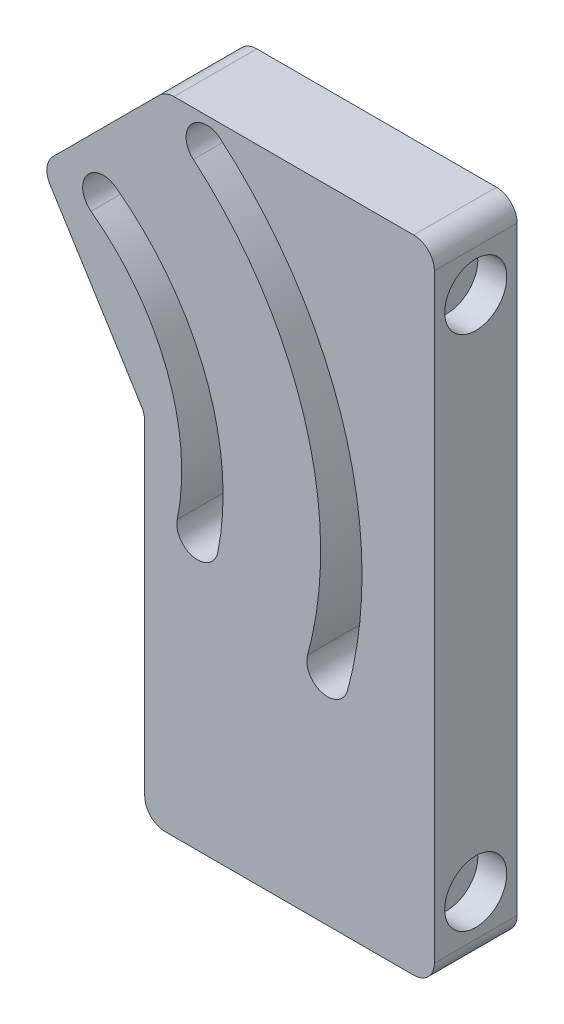
ISO-10303-21;
HEADER;
FILE_DESCRIPTION(('STEP AP214'),'2;1');
FILE_NAME('part.step','',(''),(''),'','','');
FILE_SCHEMA(('AUTOMOTIVE_DESIGN { 1 0 10303 214 1 1 1 1 }'));
ENDSEC;
DATA;
#1=APPLICATION_CONTEXT('core data for automotive mechanical design processes');
#2=APPLICATION_PROTOCOL_DEFINITION('international standard','automotive_design',2000,#1);
#3=PRODUCT_CONTEXT('',#1,'mechanical');
#4=PRODUCT('Part','Part','',(#3));
#5=PRODUCT_RELATED_PRODUCT_CATEGORY('part','',(#4));
#6=PRODUCT_DEFINITION_FORMATION('','',#4);
#7=PRODUCT_DEFINITION_CONTEXT('part definition',#1,'design');
#8=PRODUCT_DEFINITION('design','',#6,#7);
#9=PRODUCT_DEFINITION_SHAPE('','',#8);
#10=(LENGTH_UNIT() NAMED_UNIT(*) SI_UNIT(.MILLI.,.METRE.));
#11=(NAMED_UNIT(*) PLANE_ANGLE_UNIT() SI_UNIT($,.RADIAN.));
#12=(NAMED_UNIT(*) SI_UNIT($,.STERADIAN.) SOLID_ANGLE_UNIT());
#13=UNCERTAINTY_MEASURE_WITH_UNIT(LENGTH_MEASURE(1.E-05),#10,'distance_accuracy_value','');
#14=(GEOMETRIC_REPRESENTATION_CONTEXT(3) GLOBAL_UNCERTAINTY_ASSIGNED_CONTEXT((#13)) GLOBAL_UNIT_ASSIGNED_CONTEXT((#10,
#11,#12)) REPRESENTATION_CONTEXT('',''));
#15=CARTESIAN_POINT('',(0.,0.,0.));
#16=DIRECTION('',(0.,0.,1.));
#17=DIRECTION('',(1.,0.,0.));
#18=AXIS2_PLACEMENT_3D('',#15,#16,#17);
#19=CARTESIAN_POINT('',(0.,-196.747553987337,25.4));
#20=DIRECTION('',(0.,1.,0.));
#21=DIRECTION('',(0.,0.,1.));
#22=AXIS2_PLACEMENT_3D('',#19,#20,#21);
#23=PLANE('',#22);
#24=DIRECTION('',(1.,0.,0.));
#25=VECTOR('',#24,1.);
#26=CARTESIAN_POINT('',(0.,-196.747553987337,0.));
#27=LINE('',#26,#25);
#28=CARTESIAN_POINT('',(-82.55,-196.747553987337,0.));
#29=VERTEX_POINT('',#28);
#30=CARTESIAN_POINT('',(-6.34999999999997,-196.747553987337,0.));
#31=VERTEX_POINT('',#30);
#32=EDGE_CURVE('E254',#29,#31,#27,.T.);
#33=ORIENTED_EDGE('',*,*,#32,.T.);
#34=DIRECTION('',(0.,0.,-1.));
#35=VECTOR('',#34,1.);
#36=CARTESIAN_POINT('',(-6.34999999999997,-196.747553987337,25.4));
#37=LINE('',#36,#35);
#38=CARTESIAN_POINT('',(-6.34999999999997,-196.747553987337,25.4));
#39=VERTEX_POINT('',#38);
#40=EDGE_CURVE('E48',#31,#39,#37,.F.);
#41=ORIENTED_EDGE('',*,*,#40,.T.);
#42=DIRECTION('',(1.,0.,0.));
#43=VECTOR('',#42,1.);
#44=CARTESIAN_POINT('',(0.,-196.747553987337,25.4));
#45=LINE('',#44,#43);
#46=CARTESIAN_POINT('',(-82.55,-196.747553987337,25.4));
#47=VERTEX_POINT('',#46);
#48=EDGE_CURVE('E263',#47,#39,#45,.T.);
#49=ORIENTED_EDGE('',*,*,#48,.F.);
#50=DIRECTION('',(0.,0.,-1.));
#51=VECTOR('',#50,1.);
#52=CARTESIAN_POINT('',(-82.55,-196.747553987337,25.4));
#53=LINE('',#52,#51);
#54=EDGE_CURVE('E313',#47,#29,#53,.T.);
#55=ORIENTED_EDGE('',*,*,#54,.T.);
#56=EDGE_LOOP('',(#33,#41,#49,#55));
#57=FACE_BOUND('',#56,.T.);
#58=ADVANCED_FACE('F33',(#57),#23,.F.);
#59=CARTESIAN_POINT('',(0.,0.,25.4));
#60=DIRECTION('',(-1.,0.,0.));
#61=DIRECTION('',(0.,-1.,0.));
#62=AXIS2_PLACEMENT_3D('',#59,#60,#61);
#63=PLANE('',#62);
#64=CARTESIAN_POINT('',(0.,-19.05,12.7));
#65=DIRECTION('',(1.,0.,0.));
#66=DIRECTION('',(0.,1.,0.));
#67=AXIS2_PLACEMENT_3D('',#64,#65,#66);
#68=CIRCLE('',#67,9.525);
#69=CARTESIAN_POINT('',(0.,-9.525,12.7));
#70=VERTEX_POINT('',#69);
#71=EDGE_CURVE('E255',#70,#70,#68,.T.);
#72=ORIENTED_EDGE('',*,*,#71,.F.);
#73=EDGE_LOOP('',(#72));
#74=FACE_BOUND('',#73,.T.);
#75=CARTESIAN_POINT('',(0.,-177.697553987337,12.7));
#76=DIRECTION('',(1.,0.,0.));
#77=DIRECTION('',(0.,1.,0.));
#78=AXIS2_PLACEMENT_3D('',#75,#76,#77);
#79=CIRCLE('',#78,9.52499999999999);
#80=CARTESIAN_POINT('',(0.,-168.172553987337,12.7));
#81=VERTEX_POINT('',#80);
#82=EDGE_CURVE('E244',#81,#81,#79,.T.);
#83=ORIENTED_EDGE('',*,*,#82,.F.);
#84=EDGE_LOOP('',(#83));
#85=FACE_BOUND('',#84,.T.);
#86=DIRECTION('',(0.,1.,0.));
#87=VECTOR('',#86,1.);
#88=CARTESIAN_POINT('',(0.,0.,0.));
#89=LINE('',#88,#87);
#90=CARTESIAN_POINT('',(0.,-190.397553987337,0.));
#91=VERTEX_POINT('',#90);
#92=CARTESIAN_POINT('',(0.,-6.35,0.));
#93=VERTEX_POINT('',#92);
#94=EDGE_CURVE('E277',#91,#93,#89,.T.);
#95=ORIENTED_EDGE('',*,*,#94,.T.);
#96=DIRECTION('',(0.,0.,-1.));
#97=VECTOR('',#96,1.);
#98=CARTESIAN_POINT('',(0.,-6.35,25.4));
#99=LINE('',#98,#97);
#100=CARTESIAN_POINT('',(0.,-6.35,25.4));
#101=VERTEX_POINT('',#100);
#102=EDGE_CURVE('E302',#93,#101,#99,.F.);
#103=ORIENTED_EDGE('',*,*,#102,.T.);
#104=DIRECTION('',(0.,1.,0.));
#105=VECTOR('',#104,1.);
#106=CARTESIAN_POINT('',(0.,0.,25.4));
#107=LINE('',#106,#105);
#108=CARTESIAN_POINT('',(0.,-190.397553987337,25.4));
#109=VERTEX_POINT('',#108);
#110=EDGE_CURVE('E265',#109,#101,#107,.T.);
#111=ORIENTED_EDGE('',*,*,#110,.F.);
#112=DIRECTION('',(0.,0.,-1.));
#113=VECTOR('',#112,1.);
#114=CARTESIAN_POINT('',(0.,-190.397553987337,25.4));
#115=LINE('',#114,#113);
#116=EDGE_CURVE('E299',#109,#91,#115,.T.);
#117=ORIENTED_EDGE('',*,*,#116,.T.);
#118=EDGE_LOOP('',(#95,#103,#111,#117));
#119=FACE_BOUND('',#118,.T.);
#120=ADVANCED_FACE('F378',(#74,#85,#119),#63,.F.);
#121=CARTESIAN_POINT('',(-82.55,0.,25.4));
#122=DIRECTION('',(0.,-1.,0.));
#123=DIRECTION('',(0.,0.,-1.));
#124=AXIS2_PLACEMENT_3D('',#121,#122,#123);
#125=PLANE('',#124);
#126=DIRECTION('',(-1.,0.,0.));
#127=VECTOR('',#126,1.);
#128=CARTESIAN_POINT('',(-82.55,0.,25.4));
#129=LINE('',#128,#127);
#130=CARTESIAN_POINT('',(-6.34999999999999,0.,25.4));
#131=VERTEX_POINT('',#130);
#132=CARTESIAN_POINT('',(-79.9197438789308,0.,25.4));
#133=VERTEX_POINT('',#132);
#134=EDGE_CURVE('E269',#131,#133,#129,.T.);
#135=ORIENTED_EDGE('',*,*,#134,.F.);
#136=DIRECTION('',(0.,0.,-1.));
#137=VECTOR('',#136,1.);
#138=CARTESIAN_POINT('',(-6.34999999999999,0.,25.4));
#139=LINE('',#138,#137);
#140=CARTESIAN_POINT('',(-6.34999999999999,0.,0.));
#141=VERTEX_POINT('',#140);
#142=EDGE_CURVE('E286',#131,#141,#139,.T.);
#143=ORIENTED_EDGE('',*,*,#142,.T.);
#144=DIRECTION('',(-1.,0.,0.));
#145=VECTOR('',#144,1.);
#146=CARTESIAN_POINT('',(-82.55,0.,0.));
#147=LINE('',#146,#145);
#148=CARTESIAN_POINT('',(-79.9197438789308,0.,0.));
#149=VERTEX_POINT('',#148);
#150=EDGE_CURVE('E280',#141,#149,#147,.T.);
#151=ORIENTED_EDGE('',*,*,#150,.T.);
#152=DIRECTION('',(0.,0.,-1.));
#153=VECTOR('',#152,1.);
#154=CARTESIAN_POINT('',(-79.9197438789308,0.,25.4));
#155=LINE('',#154,#153);
#156=EDGE_CURVE('E275',#149,#133,#155,.F.);
#157=ORIENTED_EDGE('',*,*,#156,.T.);
#158=EDGE_LOOP('',(#135,#143,#151,#157));
#159=FACE_BOUND('',#158,.T.);
#160=ADVANCED_FACE('F370',(#159),#125,.F.);
#161=CARTESIAN_POINT('',(-120.65,-38.1,25.4));
#162=DIRECTION('',(0.707106781186548,-0.707106781186548,0.));
#163=DIRECTION('',(0.707106781186547,0.707106781186548,0.));
#164=AXIS2_PLACEMENT_3D('',#161,#162,#163);
#165=PLANE('',#164);
#166=DIRECTION('',(-0.707106781186547,-0.707106781186547,0.));
#167=VECTOR('',#166,1.);
#168=CARTESIAN_POINT('',(-120.65,-38.1,0.));
#169=LINE('',#168,#167);
#170=CARTESIAN_POINT('',(-84.4098719394654,-1.85987193946544,0.));
#171=VERTEX_POINT('',#170);
#172=CARTESIAN_POINT('',(-117.078046461003,-34.5280464610034,0.));
#173=VERTEX_POINT('',#172);
#174=EDGE_CURVE('E266',#171,#173,#169,.T.);
#175=ORIENTED_EDGE('',*,*,#174,.T.);
#176=DIRECTION('',(0.,0.,-1.));
#177=VECTOR('',#176,1.);
#178=CARTESIAN_POINT('',(-117.078046461003,-34.5280464610034,25.4));
#179=LINE('',#178,#177);
#180=CARTESIAN_POINT('',(-117.078046461003,-34.5280464610034,25.4));
#181=VERTEX_POINT('',#180);
#182=EDGE_CURVE('E330',#173,#181,#179,.F.);
#183=ORIENTED_EDGE('',*,*,#182,.T.);
#184=DIRECTION('',(-0.707106781186547,-0.707106781186547,0.));
#185=VECTOR('',#184,1.);
#186=CARTESIAN_POINT('',(-120.65,-38.1,25.4));
#187=LINE('',#186,#185);
#188=CARTESIAN_POINT('',(-84.4098719394654,-1.85987193946544,25.4));
#189=VERTEX_POINT('',#188);
#190=EDGE_CURVE('E272',#189,#181,#187,.T.);
#191=ORIENTED_EDGE('',*,*,#190,.F.);
#192=DIRECTION('',(0.,0.,-1.));
#193=VECTOR('',#192,1.);
#194=CARTESIAN_POINT('',(-84.4098719394654,-1.85987193946541,25.4));
#195=LINE('',#194,#193);
#196=EDGE_CURVE('E327',#189,#171,#195,.T.);
#197=ORIENTED_EDGE('',*,*,#196,.T.);
#198=EDGE_LOOP('',(#175,#183,#191,#197));
#199=FACE_BOUND('',#198,.T.);
#200=ADVANCED_FACE('F362',(#199),#165,.F.);
#201=CARTESIAN_POINT('',(0.,0.,25.4));
#202=DIRECTION('',(0.,0.,-1.));
#203=DIRECTION('',(-1.,0.,0.));
#204=AXIS2_PLACEMENT_3D('',#201,#202,#203);
#205=PLANE('',#204);
#206=CARTESIAN_POINT('',(-146.05,-98.3225539873368,25.4));
#207=DIRECTION('',(0.,0.,1.));
#208=DIRECTION('',(1.,0.,0.));
#209=AXIS2_PLACEMENT_3D('',#206,#207,#208);
#210=CIRCLE('',#209,123.843070913556);
#211=CARTESIAN_POINT('',(-26.6720136453094,-131.277107347978,25.4));
#212=VERTEX_POINT('',#211);
#213=CARTESIAN_POINT('',(-65.7317145876117,-4.05655141104101,25.4));
#214=VERTEX_POINT('',#213);
#215=EDGE_CURVE('E208',#212,#214,#210,.T.);
#216=ORIENTED_EDGE('',*,*,#215,.F.);
#217=CARTESIAN_POINT('',(-32.7930683620599,-129.58737685037,25.4));
#218=DIRECTION('',(0.,0.,1.));
#219=DIRECTION('',(1.,0.,0.));
#220=AXIS2_PLACEMENT_3D('',#217,#218,#219);
#221=CIRCLE('',#220,6.34999999999999);
#222=CARTESIAN_POINT('',(-38.9141230788103,-127.897646352762,25.4));
#223=VERTEX_POINT('',#222);
#224=EDGE_CURVE('E178',#223,#212,#221,.T.);
#225=ORIENTED_EDGE('',*,*,#224,.F.);
#226=CARTESIAN_POINT('',(-146.05,-98.3225539873368,25.4));
#227=DIRECTION('',(0.,0.,-1.));
#228=DIRECTION('',(1.,0.,0.));
#229=AXIS2_PLACEMENT_3D('',#226,#227,#228);
#230=CIRCLE('',#229,111.143070913556);
#231=CARTESIAN_POINT('',(-73.9682854123883,-13.723448588959,25.4));
#232=VERTEX_POINT('',#231);
#233=EDGE_CURVE('E196',#232,#223,#230,.T.);
#234=ORIENTED_EDGE('',*,*,#233,.F.);
#235=CARTESIAN_POINT('',(-69.85,-8.89,25.4));
#236=DIRECTION('',(0.,0.,1.));
#237=DIRECTION('',(1.,0.,0.));
#238=AXIS2_PLACEMENT_3D('',#235,#236,#237);
#239=CIRCLE('',#238,6.34999999999999);
#240=EDGE_CURVE('E199',#214,#232,#239,.T.);
#241=ORIENTED_EDGE('',*,*,#240,.F.);
#242=EDGE_LOOP('',(#216,#225,#234,#241));
#243=FACE_BOUND('',#242,.T.);
#244=CARTESIAN_POINT('',(-146.05,-98.3225539873368,25.4));
#245=DIRECTION('',(0.,0.,1.));
#246=DIRECTION('',(1.,0.,0.));
#247=AXIS2_PLACEMENT_3D('',#244,#245,#246);
#248=CIRCLE('',#247,81.200240539077);
#249=CARTESIAN_POINT('',(-66.4604038212078,-114.415261767594,25.4));
#250=VERTEX_POINT('',#249);
#251=CARTESIAN_POINT('',(-97.8290368345224,-32.9909553921882,25.4));
#252=VERTEX_POINT('',#251);
#253=EDGE_CURVE('E234',#250,#252,#248,.T.);
#254=ORIENTED_EDGE('',*,*,#253,.F.);
#255=CARTESIAN_POINT('',(-72.6844486316676,-113.156784037402,25.4));
#256=DIRECTION('',(0.,0.,1.));
#257=DIRECTION('',(1.,0.,0.));
#258=AXIS2_PLACEMENT_3D('',#255,#256,#257);
#259=CIRCLE('',#258,6.34999999999999);
#260=CARTESIAN_POINT('',(-78.9084934421274,-111.898306307211,25.4));
#261=VERTEX_POINT('',#260);
#262=EDGE_CURVE('E215',#261,#250,#259,.T.);
#263=ORIENTED_EDGE('',*,*,#262,.F.);
#264=CARTESIAN_POINT('',(-146.05,-98.3225539873368,25.4));
#265=DIRECTION('',(0.,0.,-1.));
#266=DIRECTION('',(1.,0.,0.));
#267=AXIS2_PLACEMENT_3D('',#264,#265,#266);
#268=CIRCLE('',#267,68.500240539077);
#269=CARTESIAN_POINT('',(-105.370963165478,-43.2090446078118,25.4));
#270=VERTEX_POINT('',#269);
#271=EDGE_CURVE('E223',#270,#261,#268,.T.);
#272=ORIENTED_EDGE('',*,*,#271,.F.);
#273=CARTESIAN_POINT('',(-101.6,-38.1,25.4));
#274=DIRECTION('',(0.,0.,1.));
#275=DIRECTION('',(1.,0.,0.));
#276=AXIS2_PLACEMENT_3D('',#273,#274,#275);
#277=CIRCLE('',#276,6.34999999999999);
#278=EDGE_CURVE('E237',#252,#270,#277,.T.);
#279=ORIENTED_EDGE('',*,*,#278,.F.);
#280=EDGE_LOOP('',(#254,#263,#272,#279));
#281=FACE_BOUND('',#280,.T.);
#282=ORIENTED_EDGE('',*,*,#110,.T.);
#283=CARTESIAN_POINT('',(-6.34999999999999,-6.35,25.4));
#284=DIRECTION('',(0.,0.,-1.));
#285=DIRECTION('',(-1.,0.,0.));
#286=AXIS2_PLACEMENT_3D('',#283,#284,#285);
#287=CIRCLE('',#286,6.35);
#288=EDGE_CURVE('E311',#101,#131,#287,.F.);
#289=ORIENTED_EDGE('',*,*,#288,.T.);
#290=ORIENTED_EDGE('',*,*,#134,.T.);
#291=CARTESIAN_POINT('',(-79.9197438789308,-6.35,25.4));
#292=DIRECTION('',(0.,0.,-1.));
#293=DIRECTION('',(-1.,0.,0.));
#294=AXIS2_PLACEMENT_3D('',#291,#292,#293);
#295=CIRCLE('',#294,6.35);
#296=EDGE_CURVE('E304',#133,#189,#295,.F.);
#297=ORIENTED_EDGE('',*,*,#296,.T.);
#298=ORIENTED_EDGE('',*,*,#190,.T.);
#299=CARTESIAN_POINT('',(-112.587918400469,-39.018174521538,25.4));
#300=DIRECTION('',(0.,0.,-1.));
#301=DIRECTION('',(-1.,0.,0.));
#302=AXIS2_PLACEMENT_3D('',#299,#300,#301);
#303=CIRCLE('',#302,6.35);
#304=CARTESIAN_POINT('',(-117.972707630901,-42.3836677905582,25.4));
#305=VERTEX_POINT('',#304);
#306=EDGE_CURVE('E306',#181,#305,#303,.F.);
#307=ORIENTED_EDGE('',*,*,#306,.T.);
#308=DIRECTION('',(-0.52999894000318,0.847998304005088,0.));
#309=VECTOR('',#308,1.);
#310=CARTESIAN_POINT('',(-120.65,-38.1,25.4));
#311=LINE('',#310,#309);
#312=CARTESIAN_POINT('',(-89.8652107695677,-87.3556627686917,25.4));
#313=VERTEX_POINT('',#312);
#314=EDGE_CURVE('E202',#313,#305,#311,.T.);
#315=ORIENTED_EDGE('',*,*,#314,.F.);
#316=CARTESIAN_POINT('',(-95.25,-90.7211560377119,25.4));
#317=DIRECTION('',(0.,0.,-1.));
#318=DIRECTION('',(-1.,0.,0.));
#319=AXIS2_PLACEMENT_3D('',#316,#317,#318);
#320=CIRCLE('',#319,6.35);
#321=CARTESIAN_POINT('',(-88.9,-90.7211560377119,25.4));
#322=VERTEX_POINT('',#321);
#323=EDGE_CURVE('E41',#313,#322,#320,.T.);
#324=ORIENTED_EDGE('',*,*,#323,.T.);
#325=DIRECTION('',(0.,1.,0.));
#326=VECTOR('',#325,1.);
#327=CARTESIAN_POINT('',(-88.9,-88.9,25.4));
#328=LINE('',#327,#326);
#329=CARTESIAN_POINT('',(-88.9,-190.397553987337,25.4));
#330=VERTEX_POINT('',#329);
#331=EDGE_CURVE('E334',#330,#322,#328,.T.);
#332=ORIENTED_EDGE('',*,*,#331,.F.);
#333=CARTESIAN_POINT('',(-82.55,-190.397553987337,25.4));
#334=DIRECTION('',(0.,0.,-1.));
#335=DIRECTION('',(-1.,0.,0.));
#336=AXIS2_PLACEMENT_3D('',#333,#334,#335);
#337=CIRCLE('',#336,6.35);
#338=EDGE_CURVE('E55',#330,#47,#337,.F.);
#339=ORIENTED_EDGE('',*,*,#338,.T.);
#340=ORIENTED_EDGE('',*,*,#48,.T.);
#341=CARTESIAN_POINT('',(-6.34999999999997,-190.397553987337,25.4));
#342=DIRECTION('',(0.,0.,-1.));
#343=DIRECTION('',(-1.,0.,0.));
#344=AXIS2_PLACEMENT_3D('',#341,#342,#343);
#345=CIRCLE('',#344,6.35);
#346=EDGE_CURVE('E309',#39,#109,#345,.F.);
#347=ORIENTED_EDGE('',*,*,#346,.T.);
#348=EDGE_LOOP('',(#282,#289,#290,#297,#298,#307,#315,#324,#332,#339,#340,#347));
#349=FACE_BOUND('',#348,.T.);
#350=ADVANCED_FACE('F333',(#243,#281,#349),#205,.F.);
#351=CARTESIAN_POINT('',(0.,0.,0.));
#352=DIRECTION('',(0.,0.,-1.));
#353=DIRECTION('',(-1.,0.,0.));
#354=AXIS2_PLACEMENT_3D('',#351,#352,#353);
#355=PLANE('',#354);
#356=ORIENTED_EDGE('',*,*,#150,.F.);
#357=CARTESIAN_POINT('',(-6.34999999999999,-6.35,0.));
#358=DIRECTION('',(0.,0.,-1.));
#359=DIRECTION('',(-1.,0.,0.));
#360=AXIS2_PLACEMENT_3D('',#357,#358,#359);
#361=CIRCLE('',#360,6.35);
#362=EDGE_CURVE('E297',#141,#93,#361,.T.);
#363=ORIENTED_EDGE('',*,*,#362,.T.);
#364=ORIENTED_EDGE('',*,*,#94,.F.);
#365=CARTESIAN_POINT('',(-6.34999999999997,-190.397553987337,0.));
#366=DIRECTION('',(0.,0.,-1.));
#367=DIRECTION('',(-1.,0.,0.));
#368=AXIS2_PLACEMENT_3D('',#365,#366,#367);
#369=CIRCLE('',#368,6.35);
#370=EDGE_CURVE('E295',#91,#31,#369,.T.);
#371=ORIENTED_EDGE('',*,*,#370,.T.);
#372=ORIENTED_EDGE('',*,*,#32,.F.);
#373=CARTESIAN_POINT('',(-82.55,-190.397553987337,0.));
#374=DIRECTION('',(0.,0.,-1.));
#375=DIRECTION('',(-1.,0.,0.));
#376=AXIS2_PLACEMENT_3D('',#373,#374,#375);
#377=CIRCLE('',#376,6.35);
#378=CARTESIAN_POINT('',(-88.9,-190.397553987337,0.));
#379=VERTEX_POINT('',#378);
#380=EDGE_CURVE('E293',#29,#379,#377,.T.);
#381=ORIENTED_EDGE('',*,*,#380,.T.);
#382=DIRECTION('',(0.,1.,0.));
#383=VECTOR('',#382,1.);
#384=CARTESIAN_POINT('',(-88.9,-88.9,0.));
#385=LINE('',#384,#383);
#386=CARTESIAN_POINT('',(-88.9,-90.7211560377119,0.));
#387=VERTEX_POINT('',#386);
#388=EDGE_CURVE('E350',#379,#387,#385,.T.);
#389=ORIENTED_EDGE('',*,*,#388,.T.);
#390=CARTESIAN_POINT('',(-95.25,-90.7211560377119,0.));
#391=DIRECTION('',(0.,0.,-1.));
#392=DIRECTION('',(-1.,0.,0.));
#393=AXIS2_PLACEMENT_3D('',#390,#391,#392);
#394=CIRCLE('',#393,6.35);
#395=CARTESIAN_POINT('',(-89.8652107695677,-87.3556627686917,0.));
#396=VERTEX_POINT('',#395);
#397=EDGE_CURVE('E11',#387,#396,#394,.F.);
#398=ORIENTED_EDGE('',*,*,#397,.T.);
#399=DIRECTION('',(-0.52999894000318,0.847998304005088,0.));
#400=VECTOR('',#399,1.);
#401=CARTESIAN_POINT('',(-120.65,-38.1,0.));
#402=LINE('',#401,#400);
#403=CARTESIAN_POINT('',(-117.972707630901,-42.3836677905582,0.));
#404=VERTEX_POINT('',#403);
#405=EDGE_CURVE('E209',#396,#404,#402,.T.);
#406=ORIENTED_EDGE('',*,*,#405,.T.);
#407=CARTESIAN_POINT('',(-112.587918400469,-39.018174521538,0.));
#408=DIRECTION('',(0.,0.,-1.));
#409=DIRECTION('',(-1.,0.,0.));
#410=AXIS2_PLACEMENT_3D('',#407,#408,#409);
#411=CIRCLE('',#410,6.35);
#412=EDGE_CURVE('E291',#404,#173,#411,.T.);
#413=ORIENTED_EDGE('',*,*,#412,.T.);
#414=ORIENTED_EDGE('',*,*,#174,.F.);
#415=CARTESIAN_POINT('',(-79.9197438789308,-6.35,0.));
#416=DIRECTION('',(0.,0.,-1.));
#417=DIRECTION('',(-1.,0.,0.));
#418=AXIS2_PLACEMENT_3D('',#415,#416,#417);
#419=CIRCLE('',#418,6.35);
#420=EDGE_CURVE('E289',#171,#149,#419,.T.);
#421=ORIENTED_EDGE('',*,*,#420,.T.);
#422=EDGE_LOOP('',(#356,#363,#364,#371,#372,#381,#389,#398,#406,#413,#414,#421));
#423=FACE_BOUND('',#422,.T.);
#424=CARTESIAN_POINT('',(-32.7930683620599,-129.58737685037,0.));
#425=DIRECTION('',(0.,0.,1.));
#426=DIRECTION('',(1.,0.,0.));
#427=AXIS2_PLACEMENT_3D('',#424,#425,#426);
#428=CIRCLE('',#427,6.34999999999999);
#429=CARTESIAN_POINT('',(-38.9141230788103,-127.897646352762,0.));
#430=VERTEX_POINT('',#429);
#431=CARTESIAN_POINT('',(-26.6720136453094,-131.277107347978,0.));
#432=VERTEX_POINT('',#431);
#433=EDGE_CURVE('E175',#430,#432,#428,.T.);
#434=ORIENTED_EDGE('',*,*,#433,.T.);
#435=CARTESIAN_POINT('',(-146.05,-98.3225539873368,0.));
#436=DIRECTION('',(0.,0.,1.));
#437=DIRECTION('',(1.,0.,0.));
#438=AXIS2_PLACEMENT_3D('',#435,#436,#437);
#439=CIRCLE('',#438,123.843070913556);
#440=CARTESIAN_POINT('',(-65.7317145876117,-4.05655141104101,0.));
#441=VERTEX_POINT('',#440);
#442=EDGE_CURVE('E187',#432,#441,#439,.T.);
#443=ORIENTED_EDGE('',*,*,#442,.T.);
#444=CARTESIAN_POINT('',(-69.85,-8.89,0.));
#445=DIRECTION('',(0.,0.,1.));
#446=DIRECTION('',(1.,0.,0.));
#447=AXIS2_PLACEMENT_3D('',#444,#445,#446);
#448=CIRCLE('',#447,6.34999999999999);
#449=CARTESIAN_POINT('',(-73.9682854123883,-13.723448588959,0.));
#450=VERTEX_POINT('',#449);
#451=EDGE_CURVE('E191',#441,#450,#448,.T.);
#452=ORIENTED_EDGE('',*,*,#451,.T.);
#453=CARTESIAN_POINT('',(-146.05,-98.3225539873368,0.));
#454=DIRECTION('',(0.,0.,-1.));
#455=DIRECTION('',(1.,0.,0.));
#456=AXIS2_PLACEMENT_3D('',#453,#454,#455);
#457=CIRCLE('',#456,111.143070913556);
#458=EDGE_CURVE('E183',#450,#430,#457,.T.);
#459=ORIENTED_EDGE('',*,*,#458,.T.);
#460=EDGE_LOOP('',(#434,#443,#452,#459));
#461=FACE_BOUND('',#460,.T.);
#462=CARTESIAN_POINT('',(-72.6844486316676,-113.156784037402,0.));
#463=DIRECTION('',(0.,0.,1.));
#464=DIRECTION('',(1.,0.,0.));
#465=AXIS2_PLACEMENT_3D('',#462,#463,#464);
#466=CIRCLE('',#465,6.34999999999999);
#467=CARTESIAN_POINT('',(-78.9084934421274,-111.898306307211,0.));
#468=VERTEX_POINT('',#467);
#469=CARTESIAN_POINT('',(-66.4604038212078,-114.415261767594,0.));
#470=VERTEX_POINT('',#469);
#471=EDGE_CURVE('E219',#468,#470,#466,.T.);
#472=ORIENTED_EDGE('',*,*,#471,.T.);
#473=CARTESIAN_POINT('',(-146.05,-98.3225539873368,0.));
#474=DIRECTION('',(0.,0.,1.));
#475=DIRECTION('',(1.,0.,0.));
#476=AXIS2_PLACEMENT_3D('',#473,#474,#475);
#477=CIRCLE('',#476,81.200240539077);
#478=CARTESIAN_POINT('',(-97.8290368345224,-32.9909553921882,0.));
#479=VERTEX_POINT('',#478);
#480=EDGE_CURVE('E222',#470,#479,#477,.T.);
#481=ORIENTED_EDGE('',*,*,#480,.T.);
#482=CARTESIAN_POINT('',(-101.6,-38.1,0.));
#483=DIRECTION('',(0.,0.,1.));
#484=DIRECTION('',(1.,0.,0.));
#485=AXIS2_PLACEMENT_3D('',#482,#483,#484);
#486=CIRCLE('',#485,6.34999999999999);
#487=CARTESIAN_POINT('',(-105.370963165478,-43.2090446078118,0.));
#488=VERTEX_POINT('',#487);
#489=EDGE_CURVE('E226',#479,#488,#486,.T.);
#490=ORIENTED_EDGE('',*,*,#489,.T.);
#491=CARTESIAN_POINT('',(-146.05,-98.3225539873368,0.));
#492=DIRECTION('',(0.,0.,-1.));
#493=DIRECTION('',(1.,0.,0.));
#494=AXIS2_PLACEMENT_3D('',#491,#492,#493);
#495=CIRCLE('',#494,68.500240539077);
#496=EDGE_CURVE('E229',#488,#468,#495,.T.);
#497=ORIENTED_EDGE('',*,*,#496,.T.);
#498=EDGE_LOOP('',(#472,#481,#490,#497));
#499=FACE_BOUND('',#498,.T.);
#500=ADVANCED_FACE('F193',(#423,#461,#499),#355,.T.);
#501=CARTESIAN_POINT('',(-8.88999999999998,-177.697553987337,12.7));
#502=DIRECTION('',(1.,0.,0.));
#503=DIRECTION('',(0.,1.,0.));
#504=AXIS2_PLACEMENT_3D('',#501,#502,#503);
#505=CYLINDRICAL_SURFACE('',#504,9.52499999999999);
#506=CARTESIAN_POINT('',(-8.88999999999998,-177.697553987337,12.7));
#507=DIRECTION('',(1.,0.,0.));
#508=DIRECTION('',(0.,1.,0.));
#509=AXIS2_PLACEMENT_3D('',#506,#507,#508);
#510=CIRCLE('',#509,9.52499999999999);
#511=CARTESIAN_POINT('',(-8.88999999999998,-168.172553987337,12.7));
#512=VERTEX_POINT('',#511);
#513=EDGE_CURVE('E258',#512,#512,#510,.T.);
#514=ORIENTED_EDGE('',*,*,#513,.F.);
#515=EDGE_LOOP('',(#514));
#516=FACE_BOUND('',#515,.T.);
#517=ORIENTED_EDGE('',*,*,#82,.T.);
#518=EDGE_LOOP('',(#517));
#519=FACE_BOUND('',#518,.T.);
#520=ADVANCED_FACE('F455',(#516,#519),#505,.F.);
#521=CARTESIAN_POINT('',(-8.88999999999998,-177.697553987337,12.7));
#522=DIRECTION('',(1.,0.,0.));
#523=DIRECTION('',(0.,1.,0.));
#524=AXIS2_PLACEMENT_3D('',#521,#522,#523);
#525=PLANE('',#524);
#526=ORIENTED_EDGE('',*,*,#513,.T.);
#527=EDGE_LOOP('',(#526));
#528=FACE_BOUND('',#527,.T.);
#529=ADVANCED_FACE('F451',(#528),#525,.T.);
#530=CARTESIAN_POINT('',(-8.89,-19.05,12.7));
#531=DIRECTION('',(1.,0.,0.));
#532=DIRECTION('',(0.,1.,0.));
#533=AXIS2_PLACEMENT_3D('',#530,#531,#532);
#534=CYLINDRICAL_SURFACE('',#533,9.525);
#535=CARTESIAN_POINT('',(-8.89,-19.05,12.7));
#536=DIRECTION('',(1.,0.,0.));
#537=DIRECTION('',(0.,1.,0.));
#538=AXIS2_PLACEMENT_3D('',#535,#536,#537);
#539=CIRCLE('',#538,9.525);
#540=CARTESIAN_POINT('',(-8.89,-9.525,12.7));
#541=VERTEX_POINT('',#540);
#542=EDGE_CURVE('E251',#541,#541,#539,.T.);
#543=ORIENTED_EDGE('',*,*,#542,.F.);
#544=EDGE_LOOP('',(#543));
#545=FACE_BOUND('',#544,.T.);
#546=ORIENTED_EDGE('',*,*,#71,.T.);
#547=EDGE_LOOP('',(#546));
#548=FACE_BOUND('',#547,.T.);
#549=ADVANCED_FACE('F447',(#545,#548),#534,.F.);
#550=CARTESIAN_POINT('',(-8.89,-19.05,12.7));
#551=DIRECTION('',(1.,0.,0.));
#552=DIRECTION('',(0.,1.,0.));
#553=AXIS2_PLACEMENT_3D('',#550,#551,#552);
#554=PLANE('',#553);
#555=ORIENTED_EDGE('',*,*,#542,.T.);
#556=EDGE_LOOP('',(#555));
#557=FACE_BOUND('',#556,.T.);
#558=ADVANCED_FACE('F443',(#557),#554,.T.);
#559=CARTESIAN_POINT('',(-72.6844486316676,-113.156784037402,0.));
#560=DIRECTION('',(0.,0.,1.));
#561=DIRECTION('',(1.,0.,0.));
#562=AXIS2_PLACEMENT_3D('',#559,#560,#561);
#563=CYLINDRICAL_SURFACE('',#562,6.34999999999999);
#564=ORIENTED_EDGE('',*,*,#262,.T.);
#565=DIRECTION('',(0.,0.,1.));
#566=VECTOR('',#565,1.);
#567=CARTESIAN_POINT('',(-66.4604038212078,-114.415261767594,0.));
#568=LINE('',#567,#566);
#569=EDGE_CURVE('E232',#470,#250,#568,.T.);
#570=ORIENTED_EDGE('',*,*,#569,.F.);
#571=ORIENTED_EDGE('',*,*,#471,.F.);
#572=DIRECTION('',(0.,0.,1.));
#573=VECTOR('',#572,1.);
#574=CARTESIAN_POINT('',(-78.9084934421274,-111.898306307211,0.));
#575=LINE('',#574,#573);
#576=EDGE_CURVE('E242',#468,#261,#575,.T.);
#577=ORIENTED_EDGE('',*,*,#576,.T.);
#578=EDGE_LOOP('',(#564,#570,#571,#577));
#579=FACE_BOUND('',#578,.T.);
#580=ADVANCED_FACE('F433',(#579),#563,.F.);
#581=CARTESIAN_POINT('',(-146.05,-98.3225539873368,0.));
#582=DIRECTION('',(0.,0.,1.));
#583=DIRECTION('',(1.,0.,0.));
#584=AXIS2_PLACEMENT_3D('',#581,#582,#583);
#585=CYLINDRICAL_SURFACE('',#584,68.500240539077);
#586=ORIENTED_EDGE('',*,*,#271,.T.);
#587=ORIENTED_EDGE('',*,*,#576,.F.);
#588=ORIENTED_EDGE('',*,*,#496,.F.);
#589=DIRECTION('',(0.,0.,1.));
#590=VECTOR('',#589,1.);
#591=CARTESIAN_POINT('',(-105.370963165478,-43.2090446078118,0.));
#592=LINE('',#591,#590);
#593=EDGE_CURVE('E245',#488,#270,#592,.T.);
#594=ORIENTED_EDGE('',*,*,#593,.T.);
#595=EDGE_LOOP('',(#586,#587,#588,#594));
#596=FACE_BOUND('',#595,.T.);
#597=ADVANCED_FACE('F429',(#596),#585,.T.);
#598=CARTESIAN_POINT('',(-101.6,-38.1,0.));
#599=DIRECTION('',(0.,0.,1.));
#600=DIRECTION('',(1.,0.,0.));
#601=AXIS2_PLACEMENT_3D('',#598,#599,#600);
#602=CYLINDRICAL_SURFACE('',#601,6.34999999999999);
#603=ORIENTED_EDGE('',*,*,#278,.T.);
#604=ORIENTED_EDGE('',*,*,#593,.F.);
#605=ORIENTED_EDGE('',*,*,#489,.F.);
#606=DIRECTION('',(0.,0.,1.));
#607=VECTOR('',#606,1.);
#608=CARTESIAN_POINT('',(-97.8290368345224,-32.9909553921882,0.));
#609=LINE('',#608,#607);
#610=EDGE_CURVE('E247',#479,#252,#609,.T.);
#611=ORIENTED_EDGE('',*,*,#610,.T.);
#612=EDGE_LOOP('',(#603,#604,#605,#611));
#613=FACE_BOUND('',#612,.T.);
#614=ADVANCED_FACE('F432',(#613),#602,.F.);
#615=CARTESIAN_POINT('',(-146.05,-98.3225539873368,0.));
#616=DIRECTION('',(0.,0.,1.));
#617=DIRECTION('',(1.,0.,0.));
#618=AXIS2_PLACEMENT_3D('',#615,#616,#617);
#619=CYLINDRICAL_SURFACE('',#618,81.200240539077);
#620=ORIENTED_EDGE('',*,*,#253,.T.);
#621=ORIENTED_EDGE('',*,*,#610,.F.);
#622=ORIENTED_EDGE('',*,*,#480,.F.);
#623=ORIENTED_EDGE('',*,*,#569,.T.);
#624=EDGE_LOOP('',(#620,#621,#622,#623));
#625=FACE_BOUND('',#624,.T.);
#626=ADVANCED_FACE('F428',(#625),#619,.F.);
#627=CARTESIAN_POINT('',(-32.7930683620599,-129.58737685037,0.));
#628=DIRECTION('',(0.,0.,1.));
#629=DIRECTION('',(1.,0.,0.));
#630=AXIS2_PLACEMENT_3D('',#627,#628,#629);
#631=CYLINDRICAL_SURFACE('',#630,6.34999999999999);
#632=ORIENTED_EDGE('',*,*,#224,.T.);
#633=DIRECTION('',(0.,0.,1.));
#634=VECTOR('',#633,1.);
#635=CARTESIAN_POINT('',(-26.6720136453094,-131.277107347978,0.));
#636=LINE('',#635,#634);
#637=EDGE_CURVE('E171',#432,#212,#636,.T.);
#638=ORIENTED_EDGE('',*,*,#637,.F.);
#639=ORIENTED_EDGE('',*,*,#433,.F.);
#640=DIRECTION('',(0.,0.,1.));
#641=VECTOR('',#640,1.);
#642=CARTESIAN_POINT('',(-38.9141230788103,-127.897646352762,0.));
#643=LINE('',#642,#641);
#644=EDGE_CURVE('E213',#430,#223,#643,.T.);
#645=ORIENTED_EDGE('',*,*,#644,.T.);
#646=EDGE_LOOP('',(#632,#638,#639,#645));
#647=FACE_BOUND('',#646,.T.);
#648=ADVANCED_FACE('F173',(#647),#631,.F.);
#649=CARTESIAN_POINT('',(-146.05,-98.3225539873368,0.));
#650=DIRECTION('',(0.,0.,1.));
#651=DIRECTION('',(1.,0.,0.));
#652=AXIS2_PLACEMENT_3D('',#649,#650,#651);
#653=CYLINDRICAL_SURFACE('',#652,111.143070913556);
#654=ORIENTED_EDGE('',*,*,#233,.T.);
#655=ORIENTED_EDGE('',*,*,#644,.F.);
#656=ORIENTED_EDGE('',*,*,#458,.F.);
#657=DIRECTION('',(0.,0.,1.));
#658=VECTOR('',#657,1.);
#659=CARTESIAN_POINT('',(-73.9682854123883,-13.723448588959,0.));
#660=LINE('',#659,#658);
#661=EDGE_CURVE('E216',#450,#232,#660,.T.);
#662=ORIENTED_EDGE('',*,*,#661,.T.);
#663=EDGE_LOOP('',(#654,#655,#656,#662));
#664=FACE_BOUND('',#663,.T.);
#665=ADVANCED_FACE('F416',(#664),#653,.T.);
#666=CARTESIAN_POINT('',(-69.85,-8.89,0.));
#667=DIRECTION('',(0.,0.,1.));
#668=DIRECTION('',(1.,0.,0.));
#669=AXIS2_PLACEMENT_3D('',#666,#667,#668);
#670=CYLINDRICAL_SURFACE('',#669,6.34999999999999);
#671=ORIENTED_EDGE('',*,*,#240,.T.);
#672=ORIENTED_EDGE('',*,*,#661,.F.);
#673=ORIENTED_EDGE('',*,*,#451,.F.);
#674=DIRECTION('',(0.,0.,1.));
#675=VECTOR('',#674,1.);
#676=CARTESIAN_POINT('',(-65.7317145876117,-4.05655141104101,0.));
#677=LINE('',#676,#675);
#678=EDGE_CURVE('E182',#441,#214,#677,.T.);
#679=ORIENTED_EDGE('',*,*,#678,.T.);
#680=EDGE_LOOP('',(#671,#672,#673,#679));
#681=FACE_BOUND('',#680,.T.);
#682=ADVANCED_FACE('F419',(#681),#670,.F.);
#683=CARTESIAN_POINT('',(-146.05,-98.3225539873368,0.));
#684=DIRECTION('',(0.,0.,1.));
#685=DIRECTION('',(1.,0.,0.));
#686=AXIS2_PLACEMENT_3D('',#683,#684,#685);
#687=CYLINDRICAL_SURFACE('',#686,123.843070913556);
#688=ORIENTED_EDGE('',*,*,#215,.T.);
#689=ORIENTED_EDGE('',*,*,#678,.F.);
#690=ORIENTED_EDGE('',*,*,#442,.F.);
#691=ORIENTED_EDGE('',*,*,#637,.T.);
#692=EDGE_LOOP('',(#688,#689,#690,#691));
#693=FACE_BOUND('',#692,.T.);
#694=ADVANCED_FACE('F188',(#693),#687,.F.);
#695=CARTESIAN_POINT('',(-120.65,-38.1,0.));
#696=DIRECTION('',(0.847998304005088,0.52999894000318,0.));
#697=DIRECTION('',(-0.52999894000318,0.847998304005088,0.));
#698=AXIS2_PLACEMENT_3D('',#695,#696,#697);
#699=PLANE('',#698);
#700=ORIENTED_EDGE('',*,*,#405,.F.);
#701=DIRECTION('',(0.,0.,1.));
#702=VECTOR('',#701,1.);
#703=CARTESIAN_POINT('',(-89.8652107695677,-87.3556627686917,25.4));
#704=LINE('',#703,#702);
#705=EDGE_CURVE('E324',#396,#313,#704,.T.);
#706=ORIENTED_EDGE('',*,*,#705,.T.);
#707=ORIENTED_EDGE('',*,*,#314,.T.);
#708=DIRECTION('',(0.,0.,-1.));
#709=VECTOR('',#708,1.);
#710=CARTESIAN_POINT('',(-117.972707630901,-42.3836677905582,0.));
#711=LINE('',#710,#709);
#712=EDGE_CURVE('E321',#305,#404,#711,.T.);
#713=ORIENTED_EDGE('',*,*,#712,.T.);
#714=EDGE_LOOP('',(#700,#706,#707,#713));
#715=FACE_BOUND('',#714,.T.);
#716=ADVANCED_FACE('F352',(#715),#699,.F.);
#717=CARTESIAN_POINT('',(-88.9,-88.9,0.));
#718=DIRECTION('',(1.,0.,0.));
#719=DIRECTION('',(0.,1.,0.));
#720=AXIS2_PLACEMENT_3D('',#717,#718,#719);
#721=PLANE('',#720);
#722=ORIENTED_EDGE('',*,*,#388,.F.);
#723=DIRECTION('',(0.,0.,-1.));
#724=VECTOR('',#723,1.);
#725=CARTESIAN_POINT('',(-88.9,-190.397553987337,0.));
#726=LINE('',#725,#724);
#727=EDGE_CURVE('E319',#379,#330,#726,.F.);
#728=ORIENTED_EDGE('',*,*,#727,.T.);
#729=ORIENTED_EDGE('',*,*,#331,.T.);
#730=DIRECTION('',(0.,0.,1.));
#731=VECTOR('',#730,1.);
#732=CARTESIAN_POINT('',(-88.9,-90.7211560377119,0.));
#733=LINE('',#732,#731);
#734=EDGE_CURVE('E317',#322,#387,#733,.F.);
#735=ORIENTED_EDGE('',*,*,#734,.T.);
#736=EDGE_LOOP('',(#722,#728,#729,#735));
#737=FACE_BOUND('',#736,.T.);
#738=ADVANCED_FACE('F341',(#737),#721,.F.);
#739=CARTESIAN_POINT('',(-6.34999999999999,-6.35,25.4));
#740=DIRECTION('',(0.,0.,-1.));
#741=DIRECTION('',(-1.,0.,0.));
#742=AXIS2_PLACEMENT_3D('',#739,#740,#741);
#743=CYLINDRICAL_SURFACE('',#742,6.35);
#744=ORIENTED_EDGE('',*,*,#288,.F.);
#745=ORIENTED_EDGE('',*,*,#102,.F.);
#746=ORIENTED_EDGE('',*,*,#362,.F.);
#747=ORIENTED_EDGE('',*,*,#142,.F.);
#748=EDGE_LOOP('',(#744,#745,#746,#747));
#749=FACE_BOUND('',#748,.T.);
#750=ADVANCED_FACE('F374',(#749),#743,.T.);
#751=CARTESIAN_POINT('',(-6.34999999999997,-190.397553987337,25.4));
#752=DIRECTION('',(0.,0.,-1.));
#753=DIRECTION('',(-1.,0.,0.));
#754=AXIS2_PLACEMENT_3D('',#751,#752,#753);
#755=CYLINDRICAL_SURFACE('',#754,6.35);
#756=ORIENTED_EDGE('',*,*,#346,.F.);
#757=ORIENTED_EDGE('',*,*,#40,.F.);
#758=ORIENTED_EDGE('',*,*,#370,.F.);
#759=ORIENTED_EDGE('',*,*,#116,.F.);
#760=EDGE_LOOP('',(#756,#757,#758,#759));
#761=FACE_BOUND('',#760,.T.);
#762=ADVANCED_FACE('F383',(#761),#755,.T.);
#763=CARTESIAN_POINT('',(-82.55,-190.397553987337,25.4));
#764=DIRECTION('',(0.,0.,-1.));
#765=DIRECTION('',(-1.,0.,0.));
#766=AXIS2_PLACEMENT_3D('',#763,#764,#765);
#767=CYLINDRICAL_SURFACE('',#766,6.35);
#768=ORIENTED_EDGE('',*,*,#338,.F.);
#769=ORIENTED_EDGE('',*,*,#727,.F.);
#770=ORIENTED_EDGE('',*,*,#380,.F.);
#771=ORIENTED_EDGE('',*,*,#54,.F.);
#772=EDGE_LOOP('',(#768,#769,#770,#771));
#773=FACE_BOUND('',#772,.T.);
#774=ADVANCED_FACE('F387',(#773),#767,.T.);
#775=CARTESIAN_POINT('',(-95.25,-90.7211560377119,0.));
#776=DIRECTION('',(0.,0.,-1.));
#777=DIRECTION('',(-1.,0.,0.));
#778=AXIS2_PLACEMENT_3D('',#775,#776,#777);
#779=CYLINDRICAL_SURFACE('',#778,6.35);
#780=ORIENTED_EDGE('',*,*,#397,.F.);
#781=ORIENTED_EDGE('',*,*,#734,.F.);
#782=ORIENTED_EDGE('',*,*,#323,.F.);
#783=ORIENTED_EDGE('',*,*,#705,.F.);
#784=EDGE_LOOP('',(#780,#781,#782,#783));
#785=FACE_BOUND('',#784,.T.);
#786=ADVANCED_FACE('F345',(#785),#779,.F.);
#787=CARTESIAN_POINT('',(-112.587918400469,-39.018174521538,0.));
#788=DIRECTION('',(0.,0.,-1.));
#789=DIRECTION('',(-1.,0.,0.));
#790=AXIS2_PLACEMENT_3D('',#787,#788,#789);
#791=CYLINDRICAL_SURFACE('',#790,6.35);
#792=ORIENTED_EDGE('',*,*,#306,.F.);
#793=ORIENTED_EDGE('',*,*,#182,.F.);
#794=ORIENTED_EDGE('',*,*,#412,.F.);
#795=ORIENTED_EDGE('',*,*,#712,.F.);
#796=EDGE_LOOP('',(#792,#793,#794,#795));
#797=FACE_BOUND('',#796,.T.);
#798=ADVANCED_FACE('F358',(#797),#791,.T.);
#799=CARTESIAN_POINT('',(-79.9197438789308,-6.35,25.4));
#800=DIRECTION('',(0.,0.,-1.));
#801=DIRECTION('',(-1.,0.,0.));
#802=AXIS2_PLACEMENT_3D('',#799,#800,#801);
#803=CYLINDRICAL_SURFACE('',#802,6.35);
#804=ORIENTED_EDGE('',*,*,#296,.F.);
#805=ORIENTED_EDGE('',*,*,#156,.F.);
#806=ORIENTED_EDGE('',*,*,#420,.F.);
#807=ORIENTED_EDGE('',*,*,#196,.F.);
#808=EDGE_LOOP('',(#804,#805,#806,#807));
#809=FACE_BOUND('',#808,.T.);
#810=ADVANCED_FACE('F35',(#809),#803,.T.);
#811=CLOSED_SHELL('',(#58,#120,#160,#200,#350,#500,#520,#529,#549,#558,#580,#597,#614,#626,#648,
#665,#682,#694,#716,#738,#750,#762,#774,#786,#798,#810));
#812=MANIFOLD_SOLID_BREP('B2',#811);
#813=ADVANCED_BREP_SHAPE_REPRESENTATION('',(#18,#812),#14);
#814=SHAPE_DEFINITION_REPRESENTATION(#9,#813);
ENDSEC;
END-ISO-10303-21;
